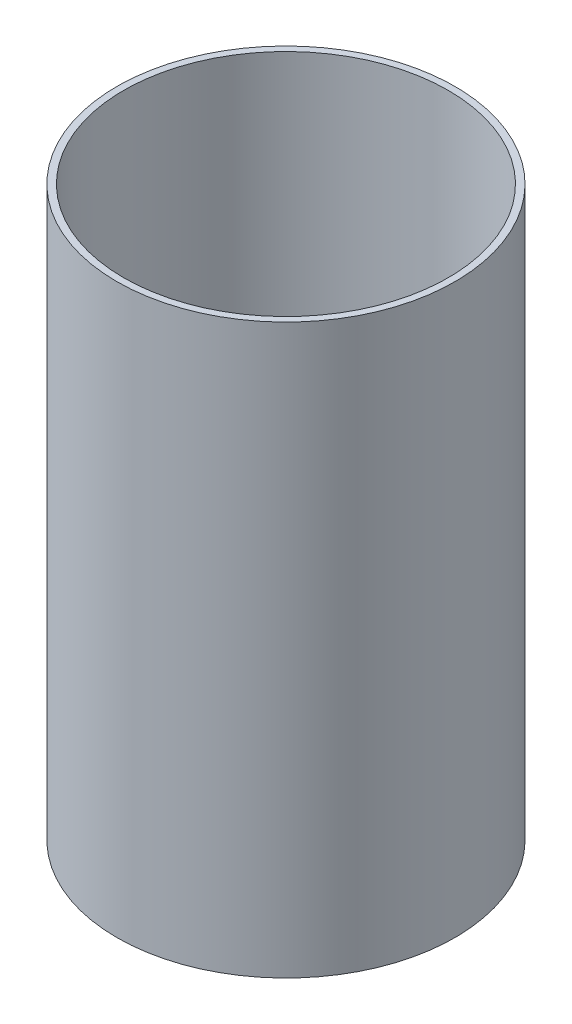
ISO-10303-21;
HEADER;
FILE_DESCRIPTION(('STEP AP214'),'2;1');
FILE_NAME('part.step','',(''),(''),'','','');
FILE_SCHEMA(('AUTOMOTIVE_DESIGN { 1 0 10303 214 1 1 1 1 }'));
ENDSEC;
DATA;
#1=APPLICATION_CONTEXT('core data for automotive mechanical design processes');
#2=APPLICATION_PROTOCOL_DEFINITION('international standard','automotive_design',2000,#1);
#3=PRODUCT_CONTEXT('',#1,'mechanical');
#4=PRODUCT('Part','Part','',(#3));
#5=PRODUCT_RELATED_PRODUCT_CATEGORY('part','',(#4));
#6=PRODUCT_DEFINITION_FORMATION('','',#4);
#7=PRODUCT_DEFINITION_CONTEXT('part definition',#1,'design');
#8=PRODUCT_DEFINITION('design','',#6,#7);
#9=PRODUCT_DEFINITION_SHAPE('','',#8);
#10=(LENGTH_UNIT() NAMED_UNIT(*) SI_UNIT(.MILLI.,.METRE.));
#11=(NAMED_UNIT(*) PLANE_ANGLE_UNIT() SI_UNIT($,.RADIAN.));
#12=(NAMED_UNIT(*) SI_UNIT($,.STERADIAN.) SOLID_ANGLE_UNIT());
#13=UNCERTAINTY_MEASURE_WITH_UNIT(LENGTH_MEASURE(1.E-05),#10,'distance_accuracy_value','');
#14=(GEOMETRIC_REPRESENTATION_CONTEXT(3) GLOBAL_UNCERTAINTY_ASSIGNED_CONTEXT((#13)) GLOBAL_UNIT_ASSIGNED_CONTEXT((#10,
#11,#12)) REPRESENTATION_CONTEXT('',''));
#15=CARTESIAN_POINT('',(0.,0.,0.));
#16=DIRECTION('',(0.,0.,1.));
#17=DIRECTION('',(1.,0.,0.));
#18=AXIS2_PLACEMENT_3D('',#15,#16,#17);
#19=CARTESIAN_POINT('',(0.,55.,0.));
#20=DIRECTION('',(0.,1.,0.));
#21=DIRECTION('',(0.,0.,1.));
#22=AXIS2_PLACEMENT_3D('',#19,#20,#21);
#23=CYLINDRICAL_SURFACE('',#22,39.6875);
#24=CARTESIAN_POINT('',(0.,-133.35,0.));
#25=DIRECTION('',(0.,1.,0.));
#26=DIRECTION('',(0.,0.,1.));
#27=AXIS2_PLACEMENT_3D('',#24,#25,#26);
#28=CIRCLE('',#27,39.6875);
#29=CARTESIAN_POINT('',(0.,-133.35,39.6875));
#30=VERTEX_POINT('',#29);
#31=EDGE_CURVE('E10',#30,#30,#28,.T.);
#32=ORIENTED_EDGE('',*,*,#31,.T.);
#33=EDGE_LOOP('',(#32));
#34=FACE_BOUND('',#33,.T.);
#35=CARTESIAN_POINT('',(0.,0.,0.));
#36=DIRECTION('',(0.,1.,0.));
#37=DIRECTION('',(0.,0.,1.));
#38=AXIS2_PLACEMENT_3D('',#35,#36,#37);
#39=CIRCLE('',#38,39.6875);
#40=CARTESIAN_POINT('',(0.,0.,39.6875));
#41=VERTEX_POINT('',#40);
#42=EDGE_CURVE('E47',#41,#41,#39,.T.);
#43=ORIENTED_EDGE('',*,*,#42,.F.);
#44=EDGE_LOOP('',(#43));
#45=FACE_BOUND('',#44,.T.);
#46=ADVANCED_FACE('F33',(#34,#45),#23,.T.);
#47=CARTESIAN_POINT('',(-39.6875,-133.35,0.));
#48=DIRECTION('',(0.,-1.,0.));
#49=DIRECTION('',(0.,0.,-1.));
#50=AXIS2_PLACEMENT_3D('',#47,#48,#49);
#51=PLANE('',#50);
#52=CARTESIAN_POINT('',(0.,-133.35,0.));
#53=DIRECTION('',(0.,1.,0.));
#54=DIRECTION('',(0.,0.,1.));
#55=AXIS2_PLACEMENT_3D('',#52,#53,#54);
#56=CIRCLE('',#55,38.1);
#57=CARTESIAN_POINT('',(0.,-133.35,38.1));
#58=VERTEX_POINT('',#57);
#59=EDGE_CURVE('E39',#58,#58,#56,.T.);
#60=ORIENTED_EDGE('',*,*,#59,.T.);
#61=EDGE_LOOP('',(#60));
#62=FACE_BOUND('',#61,.T.);
#63=ORIENTED_EDGE('',*,*,#31,.F.);
#64=EDGE_LOOP('',(#63));
#65=FACE_BOUND('',#64,.T.);
#66=ADVANCED_FACE('F57',(#62,#65),#51,.T.);
#67=CARTESIAN_POINT('',(0.,55.,0.));
#68=DIRECTION('',(0.,1.,0.));
#69=DIRECTION('',(0.,0.,1.));
#70=AXIS2_PLACEMENT_3D('',#67,#68,#69);
#71=CYLINDRICAL_SURFACE('',#70,38.1);
#72=CARTESIAN_POINT('',(0.,0.,0.));
#73=DIRECTION('',(0.,1.,0.));
#74=DIRECTION('',(0.,0.,1.));
#75=AXIS2_PLACEMENT_3D('',#72,#73,#74);
#76=CIRCLE('',#75,38.1);
#77=CARTESIAN_POINT('',(0.,0.,38.1));
#78=VERTEX_POINT('',#77);
#79=EDGE_CURVE('E43',#78,#78,#76,.T.);
#80=ORIENTED_EDGE('',*,*,#79,.T.);
#81=EDGE_LOOP('',(#80));
#82=FACE_BOUND('',#81,.T.);
#83=ORIENTED_EDGE('',*,*,#59,.F.);
#84=EDGE_LOOP('',(#83));
#85=FACE_BOUND('',#84,.T.);
#86=ADVANCED_FACE('F61',(#82,#85),#71,.F.);
#87=CARTESIAN_POINT('',(-39.6875,0.,0.));
#88=DIRECTION('',(0.,1.,0.));
#89=DIRECTION('',(0.,0.,1.));
#90=AXIS2_PLACEMENT_3D('',#87,#88,#89);
#91=PLANE('',#90);
#92=ORIENTED_EDGE('',*,*,#42,.T.);
#93=EDGE_LOOP('',(#92));
#94=FACE_BOUND('',#93,.T.);
#95=ORIENTED_EDGE('',*,*,#79,.F.);
#96=EDGE_LOOP('',(#95));
#97=FACE_BOUND('',#96,.T.);
#98=ADVANCED_FACE('F53',(#94,#97),#91,.T.);
#99=CLOSED_SHELL('',(#46,#66,#86,#98));
#100=MANIFOLD_SOLID_BREP('B2',#99);
#101=ADVANCED_BREP_SHAPE_REPRESENTATION('',(#18,#100),#14);
#102=SHAPE_DEFINITION_REPRESENTATION(#9,#101);
ENDSEC;
END-ISO-10303-21;
